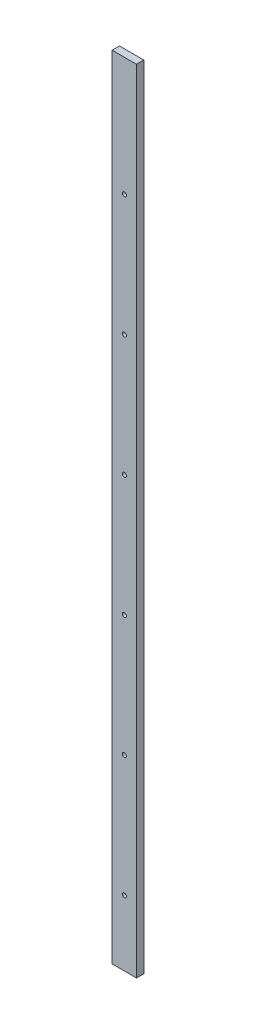
ISO-10303-21;
HEADER;
FILE_DESCRIPTION(('STEP AP214'),'2;1');
FILE_NAME('part.step','',(''),(''),'','','');
FILE_SCHEMA(('AUTOMOTIVE_DESIGN { 1 0 10303 214 1 1 1 1 }'));
ENDSEC;
DATA;
#1=APPLICATION_CONTEXT('core data for automotive mechanical design processes');
#2=APPLICATION_PROTOCOL_DEFINITION('international standard','automotive_design',2000,#1);
#3=PRODUCT_CONTEXT('',#1,'mechanical');
#4=PRODUCT('Part','Part','',(#3));
#5=PRODUCT_RELATED_PRODUCT_CATEGORY('part','',(#4));
#6=PRODUCT_DEFINITION_FORMATION('','',#4);
#7=PRODUCT_DEFINITION_CONTEXT('part definition',#1,'design');
#8=PRODUCT_DEFINITION('design','',#6,#7);
#9=PRODUCT_DEFINITION_SHAPE('','',#8);
#10=(LENGTH_UNIT() NAMED_UNIT(*) SI_UNIT(.MILLI.,.METRE.));
#11=(NAMED_UNIT(*) PLANE_ANGLE_UNIT() SI_UNIT($,.RADIAN.));
#12=(NAMED_UNIT(*) SI_UNIT($,.STERADIAN.) SOLID_ANGLE_UNIT());
#13=UNCERTAINTY_MEASURE_WITH_UNIT(LENGTH_MEASURE(1.E-05),#10,'distance_accuracy_value','');
#14=(GEOMETRIC_REPRESENTATION_CONTEXT(3) GLOBAL_UNCERTAINTY_ASSIGNED_CONTEXT((#13)) GLOBAL_UNIT_ASSIGNED_CONTEXT((#10,
#11,#12)) REPRESENTATION_CONTEXT('',''));
#15=CARTESIAN_POINT('',(0.,0.,0.));
#16=DIRECTION('',(0.,0.,1.));
#17=DIRECTION('',(1.,0.,0.));
#18=AXIS2_PLACEMENT_3D('',#15,#16,#17);
#19=CARTESIAN_POINT('',(20.,-1303.36,6.));
#20=DIRECTION('',(1.,0.,0.));
#21=DIRECTION('',(0.,0.,-1.));
#22=AXIS2_PLACEMENT_3D('',#19,#20,#21);
#23=PLANE('',#22);
#24=DIRECTION('',(0.,0.,-1.));
#25=VECTOR('',#24,1.);
#26=CARTESIAN_POINT('',(20.,0.,6.));
#27=LINE('',#26,#25);
#28=CARTESIAN_POINT('',(20.,0.,6.));
#29=VERTEX_POINT('',#28);
#30=CARTESIAN_POINT('',(20.,0.,-6.));
#31=VERTEX_POINT('',#30);
#32=EDGE_CURVE('E100',#29,#31,#27,.T.);
#33=ORIENTED_EDGE('',*,*,#32,.F.);
#34=DIRECTION('',(0.,1.,0.));
#35=VECTOR('',#34,1.);
#36=CARTESIAN_POINT('',(20.,-1303.36,6.));
#37=LINE('',#36,#35);
#38=CARTESIAN_POINT('',(20.,-1303.36,6.));
#39=VERTEX_POINT('',#38);
#40=EDGE_CURVE('E11',#39,#29,#37,.T.);
#41=ORIENTED_EDGE('',*,*,#40,.F.);
#42=DIRECTION('',(0.,0.,-1.));
#43=VECTOR('',#42,1.);
#44=CARTESIAN_POINT('',(20.,-1303.36,6.));
#45=LINE('',#44,#43);
#46=CARTESIAN_POINT('',(20.,-1303.36,-6.));
#47=VERTEX_POINT('',#46);
#48=EDGE_CURVE('E93',#39,#47,#45,.T.);
#49=ORIENTED_EDGE('',*,*,#48,.T.);
#50=DIRECTION('',(0.,1.,0.));
#51=VECTOR('',#50,1.);
#52=CARTESIAN_POINT('',(20.,-1303.36,-6.));
#53=LINE('',#52,#51);
#54=EDGE_CURVE('E38',#47,#31,#53,.T.);
#55=ORIENTED_EDGE('',*,*,#54,.T.);
#56=EDGE_LOOP('',(#33,#41,#49,#55));
#57=FACE_BOUND('',#56,.T.);
#58=ADVANCED_FACE('F35',(#57),#23,.T.);
#59=CARTESIAN_POINT('',(-20.,-1303.36,6.));
#60=DIRECTION('',(0.,0.,1.));
#61=DIRECTION('',(1.,0.,0.));
#62=AXIS2_PLACEMENT_3D('',#59,#60,#61);
#63=PLANE('',#62);
#64=CARTESIAN_POINT('',(0.,-1195.5,6.));
#65=DIRECTION('',(0.,0.,1.));
#66=DIRECTION('',(1.,0.,0.));
#67=AXIS2_PLACEMENT_3D('',#64,#65,#66);
#68=CIRCLE('',#67,3.39999999999997);
#69=CARTESIAN_POINT('',(3.39999999999997,-1195.5,6.));
#70=VERTEX_POINT('',#69);
#71=EDGE_CURVE('E168',#70,#70,#68,.T.);
#72=ORIENTED_EDGE('',*,*,#71,.F.);
#73=EDGE_LOOP('',(#72));
#74=FACE_BOUND('',#73,.T.);
#75=CARTESIAN_POINT('',(0.,-595.5,6.));
#76=DIRECTION('',(0.,0.,1.));
#77=DIRECTION('',(1.,0.,0.));
#78=AXIS2_PLACEMENT_3D('',#75,#76,#77);
#79=CIRCLE('',#78,3.39999999999997);
#80=CARTESIAN_POINT('',(3.39999999999997,-595.5,6.));
#81=VERTEX_POINT('',#80);
#82=EDGE_CURVE('E172',#81,#81,#79,.T.);
#83=ORIENTED_EDGE('',*,*,#82,.F.);
#84=EDGE_LOOP('',(#83));
#85=FACE_BOUND('',#84,.T.);
#86=CARTESIAN_POINT('',(0.,-195.5,6.));
#87=DIRECTION('',(0.,0.,1.));
#88=DIRECTION('',(1.,0.,0.));
#89=AXIS2_PLACEMENT_3D('',#86,#87,#88);
#90=CIRCLE('',#89,3.39999999999999);
#91=CARTESIAN_POINT('',(3.39999999999999,-195.5,6.));
#92=VERTEX_POINT('',#91);
#93=EDGE_CURVE('E156',#92,#92,#90,.T.);
#94=ORIENTED_EDGE('',*,*,#93,.F.);
#95=EDGE_LOOP('',(#94));
#96=FACE_BOUND('',#95,.T.);
#97=CARTESIAN_POINT('',(0.,-395.5,6.));
#98=DIRECTION('',(0.,0.,1.));
#99=DIRECTION('',(1.,0.,0.));
#100=AXIS2_PLACEMENT_3D('',#97,#98,#99);
#101=CIRCLE('',#100,3.39999999999999);
#102=CARTESIAN_POINT('',(3.39999999999999,-395.5,6.));
#103=VERTEX_POINT('',#102);
#104=EDGE_CURVE('E160',#103,#103,#101,.T.);
#105=ORIENTED_EDGE('',*,*,#104,.F.);
#106=EDGE_LOOP('',(#105));
#107=FACE_BOUND('',#106,.T.);
#108=CARTESIAN_POINT('',(0.,-795.5,6.));
#109=DIRECTION('',(0.,0.,1.));
#110=DIRECTION('',(1.,0.,0.));
#111=AXIS2_PLACEMENT_3D('',#108,#109,#110);
#112=CIRCLE('',#111,3.39999999999997);
#113=CARTESIAN_POINT('',(3.39999999999997,-795.5,6.));
#114=VERTEX_POINT('',#113);
#115=EDGE_CURVE('E164',#114,#114,#112,.T.);
#116=ORIENTED_EDGE('',*,*,#115,.F.);
#117=EDGE_LOOP('',(#116));
#118=FACE_BOUND('',#117,.T.);
#119=CARTESIAN_POINT('',(0.,-995.5,6.));
#120=DIRECTION('',(0.,0.,1.));
#121=DIRECTION('',(1.,0.,0.));
#122=AXIS2_PLACEMENT_3D('',#119,#120,#121);
#123=CIRCLE('',#122,3.39999999999997);
#124=CARTESIAN_POINT('',(3.39999999999997,-995.5,6.));
#125=VERTEX_POINT('',#124);
#126=EDGE_CURVE('E152',#125,#125,#123,.T.);
#127=ORIENTED_EDGE('',*,*,#126,.F.);
#128=EDGE_LOOP('',(#127));
#129=FACE_BOUND('',#128,.T.);
#130=DIRECTION('',(1.,0.,0.));
#131=VECTOR('',#130,1.);
#132=CARTESIAN_POINT('',(-20.,0.,6.));
#133=LINE('',#132,#131);
#134=CARTESIAN_POINT('',(-20.,0.,6.));
#135=VERTEX_POINT('',#134);
#136=EDGE_CURVE('E95',#135,#29,#133,.T.);
#137=ORIENTED_EDGE('',*,*,#136,.F.);
#138=DIRECTION('',(0.,1.,0.));
#139=VECTOR('',#138,1.);
#140=CARTESIAN_POINT('',(-20.,-1303.36,6.));
#141=LINE('',#140,#139);
#142=CARTESIAN_POINT('',(-20.,-1303.36,6.));
#143=VERTEX_POINT('',#142);
#144=EDGE_CURVE('E44',#143,#135,#141,.T.);
#145=ORIENTED_EDGE('',*,*,#144,.F.);
#146=DIRECTION('',(1.,0.,0.));
#147=VECTOR('',#146,1.);
#148=CARTESIAN_POINT('',(-20.,-1303.36,6.));
#149=LINE('',#148,#147);
#150=EDGE_CURVE('E90',#143,#39,#149,.T.);
#151=ORIENTED_EDGE('',*,*,#150,.T.);
#152=ORIENTED_EDGE('',*,*,#40,.T.);
#153=EDGE_LOOP('',(#137,#145,#151,#152));
#154=FACE_BOUND('',#153,.T.);
#155=ADVANCED_FACE('F111',(#74,#85,#96,#107,#118,#129,#154),#63,.T.);
#156=CARTESIAN_POINT('',(-20.,-1303.36,6.));
#157=DIRECTION('',(-1.,0.,0.));
#158=DIRECTION('',(0.,0.,1.));
#159=AXIS2_PLACEMENT_3D('',#156,#157,#158);
#160=PLANE('',#159);
#161=DIRECTION('',(0.,0.,1.));
#162=VECTOR('',#161,1.);
#163=CARTESIAN_POINT('',(-20.,0.,6.));
#164=LINE('',#163,#162);
#165=CARTESIAN_POINT('',(-20.,0.,-6.));
#166=VERTEX_POINT('',#165);
#167=EDGE_CURVE('E85',#166,#135,#164,.T.);
#168=ORIENTED_EDGE('',*,*,#167,.F.);
#169=DIRECTION('',(0.,1.,0.));
#170=VECTOR('',#169,1.);
#171=CARTESIAN_POINT('',(-20.,-1303.36,-6.));
#172=LINE('',#171,#170);
#173=CARTESIAN_POINT('',(-20.,-1303.36,-6.));
#174=VERTEX_POINT('',#173);
#175=EDGE_CURVE('E80',#174,#166,#172,.T.);
#176=ORIENTED_EDGE('',*,*,#175,.F.);
#177=DIRECTION('',(0.,0.,1.));
#178=VECTOR('',#177,1.);
#179=CARTESIAN_POINT('',(-20.,-1303.36,6.));
#180=LINE('',#179,#178);
#181=EDGE_CURVE('E83',#174,#143,#180,.T.);
#182=ORIENTED_EDGE('',*,*,#181,.T.);
#183=ORIENTED_EDGE('',*,*,#144,.T.);
#184=EDGE_LOOP('',(#168,#176,#182,#183));
#185=FACE_BOUND('',#184,.T.);
#186=ADVANCED_FACE('F82',(#185),#160,.T.);
#187=CARTESIAN_POINT('',(-20.,-1303.36,-6.));
#188=DIRECTION('',(0.,0.,-1.));
#189=DIRECTION('',(-1.,0.,0.));
#190=AXIS2_PLACEMENT_3D('',#187,#188,#189);
#191=PLANE('',#190);
#192=CARTESIAN_POINT('',(0.,-1195.5,-6.));
#193=DIRECTION('',(0.,0.,1.));
#194=DIRECTION('',(1.,0.,0.));
#195=AXIS2_PLACEMENT_3D('',#192,#193,#194);
#196=CIRCLE('',#195,3.39999999999997);
#197=CARTESIAN_POINT('',(3.39999999999997,-1195.5,-6.));
#198=VERTEX_POINT('',#197);
#199=EDGE_CURVE('E132',#198,#198,#196,.T.);
#200=ORIENTED_EDGE('',*,*,#199,.T.);
#201=EDGE_LOOP('',(#200));
#202=FACE_BOUND('',#201,.T.);
#203=CARTESIAN_POINT('',(0.,-595.5,-6.));
#204=DIRECTION('',(0.,0.,1.));
#205=DIRECTION('',(1.,0.,0.));
#206=AXIS2_PLACEMENT_3D('',#203,#204,#205);
#207=CIRCLE('',#206,3.39999999999997);
#208=CARTESIAN_POINT('',(3.39999999999997,-595.5,-6.));
#209=VERTEX_POINT('',#208);
#210=EDGE_CURVE('E136',#209,#209,#207,.T.);
#211=ORIENTED_EDGE('',*,*,#210,.T.);
#212=EDGE_LOOP('',(#211));
#213=FACE_BOUND('',#212,.T.);
#214=CARTESIAN_POINT('',(0.,-195.5,-6.));
#215=DIRECTION('',(0.,0.,1.));
#216=DIRECTION('',(1.,0.,0.));
#217=AXIS2_PLACEMENT_3D('',#214,#215,#216);
#218=CIRCLE('',#217,3.39999999999999);
#219=CARTESIAN_POINT('',(3.39999999999999,-195.5,-6.));
#220=VERTEX_POINT('',#219);
#221=EDGE_CURVE('E140',#220,#220,#218,.T.);
#222=ORIENTED_EDGE('',*,*,#221,.T.);
#223=EDGE_LOOP('',(#222));
#224=FACE_BOUND('',#223,.T.);
#225=CARTESIAN_POINT('',(0.,-395.5,-6.));
#226=DIRECTION('',(0.,0.,1.));
#227=DIRECTION('',(1.,0.,0.));
#228=AXIS2_PLACEMENT_3D('',#225,#226,#227);
#229=CIRCLE('',#228,3.39999999999999);
#230=CARTESIAN_POINT('',(3.39999999999999,-395.5,-6.));
#231=VERTEX_POINT('',#230);
#232=EDGE_CURVE('E144',#231,#231,#229,.T.);
#233=ORIENTED_EDGE('',*,*,#232,.T.);
#234=EDGE_LOOP('',(#233));
#235=FACE_BOUND('',#234,.T.);
#236=CARTESIAN_POINT('',(0.,-795.5,-6.));
#237=DIRECTION('',(0.,0.,1.));
#238=DIRECTION('',(1.,0.,0.));
#239=AXIS2_PLACEMENT_3D('',#236,#237,#238);
#240=CIRCLE('',#239,3.39999999999997);
#241=CARTESIAN_POINT('',(3.39999999999997,-795.5,-6.));
#242=VERTEX_POINT('',#241);
#243=EDGE_CURVE('E148',#242,#242,#240,.T.);
#244=ORIENTED_EDGE('',*,*,#243,.T.);
#245=EDGE_LOOP('',(#244));
#246=FACE_BOUND('',#245,.T.);
#247=CARTESIAN_POINT('',(0.,-995.5,-6.));
#248=DIRECTION('',(0.,0.,1.));
#249=DIRECTION('',(1.,0.,0.));
#250=AXIS2_PLACEMENT_3D('',#247,#248,#249);
#251=CIRCLE('',#250,3.39999999999997);
#252=CARTESIAN_POINT('',(3.39999999999997,-995.5,-6.));
#253=VERTEX_POINT('',#252);
#254=EDGE_CURVE('E104',#253,#253,#251,.T.);
#255=ORIENTED_EDGE('',*,*,#254,.T.);
#256=EDGE_LOOP('',(#255));
#257=FACE_BOUND('',#256,.T.);
#258=DIRECTION('',(-1.,0.,0.));
#259=VECTOR('',#258,1.);
#260=CARTESIAN_POINT('',(-20.,0.,-6.));
#261=LINE('',#260,#259);
#262=EDGE_CURVE('E103',#31,#166,#261,.T.);
#263=ORIENTED_EDGE('',*,*,#262,.F.);
#264=ORIENTED_EDGE('',*,*,#54,.F.);
#265=DIRECTION('',(-1.,0.,0.));
#266=VECTOR('',#265,1.);
#267=CARTESIAN_POINT('',(-20.,-1303.36,-6.));
#268=LINE('',#267,#266);
#269=EDGE_CURVE('E89',#47,#174,#268,.T.);
#270=ORIENTED_EDGE('',*,*,#269,.T.);
#271=ORIENTED_EDGE('',*,*,#175,.T.);
#272=EDGE_LOOP('',(#263,#264,#270,#271));
#273=FACE_BOUND('',#272,.T.);
#274=ADVANCED_FACE('F92',(#202,#213,#224,#235,#246,#257,#273),#191,.T.);
#275=CARTESIAN_POINT('',(0.,-1303.36,0.));
#276=DIRECTION('',(0.,-1.,0.));
#277=DIRECTION('',(0.,0.,-1.));
#278=AXIS2_PLACEMENT_3D('',#275,#276,#277);
#279=PLANE('',#278);
#280=ORIENTED_EDGE('',*,*,#48,.F.);
#281=ORIENTED_EDGE('',*,*,#150,.F.);
#282=ORIENTED_EDGE('',*,*,#181,.F.);
#283=ORIENTED_EDGE('',*,*,#269,.F.);
#284=EDGE_LOOP('',(#280,#281,#282,#283));
#285=FACE_BOUND('',#284,.T.);
#286=ADVANCED_FACE('F88',(#285),#279,.T.);
#287=CARTESIAN_POINT('',(0.,0.,0.));
#288=DIRECTION('',(0.,-1.,0.));
#289=DIRECTION('',(0.,0.,-1.));
#290=AXIS2_PLACEMENT_3D('',#287,#288,#289);
#291=PLANE('',#290);
#292=ORIENTED_EDGE('',*,*,#32,.T.);
#293=ORIENTED_EDGE('',*,*,#262,.T.);
#294=ORIENTED_EDGE('',*,*,#167,.T.);
#295=ORIENTED_EDGE('',*,*,#136,.T.);
#296=EDGE_LOOP('',(#292,#293,#294,#295));
#297=FACE_BOUND('',#296,.T.);
#298=ADVANCED_FACE('F110',(#297),#291,.F.);
#299=CARTESIAN_POINT('',(0.,-995.5,-6.));
#300=DIRECTION('',(0.,0.,1.));
#301=DIRECTION('',(1.,0.,0.));
#302=AXIS2_PLACEMENT_3D('',#299,#300,#301);
#303=CYLINDRICAL_SURFACE('',#302,3.39999999999997);
#304=ORIENTED_EDGE('',*,*,#254,.F.);
#305=EDGE_LOOP('',(#304));
#306=FACE_BOUND('',#305,.T.);
#307=ORIENTED_EDGE('',*,*,#126,.T.);
#308=EDGE_LOOP('',(#307));
#309=FACE_BOUND('',#308,.T.);
#310=ADVANCED_FACE('F187',(#306,#309),#303,.F.);
#311=CARTESIAN_POINT('',(0.,-795.5,-6.));
#312=DIRECTION('',(0.,0.,1.));
#313=DIRECTION('',(1.,0.,0.));
#314=AXIS2_PLACEMENT_3D('',#311,#312,#313);
#315=CYLINDRICAL_SURFACE('',#314,3.39999999999997);
#316=ORIENTED_EDGE('',*,*,#243,.F.);
#317=EDGE_LOOP('',(#316));
#318=FACE_BOUND('',#317,.T.);
#319=ORIENTED_EDGE('',*,*,#115,.T.);
#320=EDGE_LOOP('',(#319));
#321=FACE_BOUND('',#320,.T.);
#322=ADVANCED_FACE('F189',(#318,#321),#315,.F.);
#323=CARTESIAN_POINT('',(0.,-395.5,-6.));
#324=DIRECTION('',(0.,0.,1.));
#325=DIRECTION('',(1.,0.,0.));
#326=AXIS2_PLACEMENT_3D('',#323,#324,#325);
#327=CYLINDRICAL_SURFACE('',#326,3.39999999999999);
#328=ORIENTED_EDGE('',*,*,#232,.F.);
#329=EDGE_LOOP('',(#328));
#330=FACE_BOUND('',#329,.T.);
#331=ORIENTED_EDGE('',*,*,#104,.T.);
#332=EDGE_LOOP('',(#331));
#333=FACE_BOUND('',#332,.T.);
#334=ADVANCED_FACE('F195',(#330,#333),#327,.F.);
#335=CARTESIAN_POINT('',(0.,-195.5,-6.));
#336=DIRECTION('',(0.,0.,1.));
#337=DIRECTION('',(1.,0.,0.));
#338=AXIS2_PLACEMENT_3D('',#335,#336,#337);
#339=CYLINDRICAL_SURFACE('',#338,3.39999999999999);
#340=ORIENTED_EDGE('',*,*,#221,.F.);
#341=EDGE_LOOP('',(#340));
#342=FACE_BOUND('',#341,.T.);
#343=ORIENTED_EDGE('',*,*,#93,.T.);
#344=EDGE_LOOP('',(#343));
#345=FACE_BOUND('',#344,.T.);
#346=ADVANCED_FACE('F199',(#342,#345),#339,.F.);
#347=CARTESIAN_POINT('',(0.,-595.5,-6.));
#348=DIRECTION('',(0.,0.,1.));
#349=DIRECTION('',(1.,0.,0.));
#350=AXIS2_PLACEMENT_3D('',#347,#348,#349);
#351=CYLINDRICAL_SURFACE('',#350,3.39999999999997);
#352=ORIENTED_EDGE('',*,*,#210,.F.);
#353=EDGE_LOOP('',(#352));
#354=FACE_BOUND('',#353,.T.);
#355=ORIENTED_EDGE('',*,*,#82,.T.);
#356=EDGE_LOOP('',(#355));
#357=FACE_BOUND('',#356,.T.);
#358=ADVANCED_FACE('F177',(#354,#357),#351,.F.);
#359=CARTESIAN_POINT('',(0.,-1195.5,-6.));
#360=DIRECTION('',(0.,0.,1.));
#361=DIRECTION('',(1.,0.,0.));
#362=AXIS2_PLACEMENT_3D('',#359,#360,#361);
#363=CYLINDRICAL_SURFACE('',#362,3.39999999999997);
#364=ORIENTED_EDGE('',*,*,#199,.F.);
#365=EDGE_LOOP('',(#364));
#366=FACE_BOUND('',#365,.T.);
#367=ORIENTED_EDGE('',*,*,#71,.T.);
#368=EDGE_LOOP('',(#367));
#369=FACE_BOUND('',#368,.T.);
#370=ADVANCED_FACE('F206',(#366,#369),#363,.F.);
#371=CLOSED_SHELL('',(#58,#155,#186,#274,#286,#298,#310,#322,#334,#346,#358,#370));
#372=MANIFOLD_SOLID_BREP('B2',#371);
#373=ADVANCED_BREP_SHAPE_REPRESENTATION('',(#18,#372),#14);
#374=SHAPE_DEFINITION_REPRESENTATION(#9,#373);
ENDSEC;
END-ISO-10303-21;
